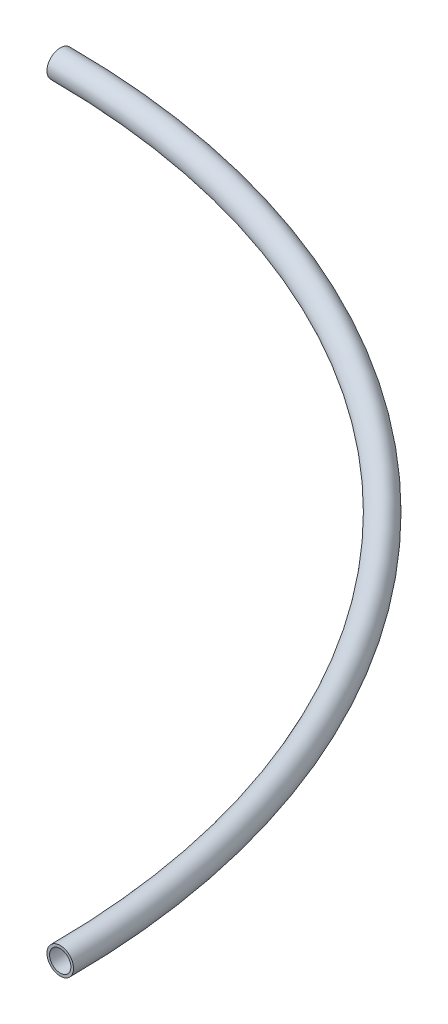
ISO-10303-21;
HEADER;
FILE_DESCRIPTION(('STEP AP214'),'2;1');
FILE_NAME('part.step','',(''),(''),'','','');
FILE_SCHEMA(('AUTOMOTIVE_DESIGN { 1 0 10303 214 1 1 1 1 }'));
ENDSEC;
DATA;
#1=APPLICATION_CONTEXT('core data for automotive mechanical design processes');
#2=APPLICATION_PROTOCOL_DEFINITION('international standard','automotive_design',2000,#1);
#3=PRODUCT_CONTEXT('',#1,'mechanical');
#4=PRODUCT('Part','Part','',(#3));
#5=PRODUCT_RELATED_PRODUCT_CATEGORY('part','',(#4));
#6=PRODUCT_DEFINITION_FORMATION('','',#4);
#7=PRODUCT_DEFINITION_CONTEXT('part definition',#1,'design');
#8=PRODUCT_DEFINITION('design','',#6,#7);
#9=PRODUCT_DEFINITION_SHAPE('','',#8);
#10=(LENGTH_UNIT() NAMED_UNIT(*) SI_UNIT(.MILLI.,.METRE.));
#11=(NAMED_UNIT(*) PLANE_ANGLE_UNIT() SI_UNIT($,.RADIAN.));
#12=(NAMED_UNIT(*) SI_UNIT($,.STERADIAN.) SOLID_ANGLE_UNIT());
#13=UNCERTAINTY_MEASURE_WITH_UNIT(LENGTH_MEASURE(1.E-05),#10,'distance_accuracy_value','');
#14=(GEOMETRIC_REPRESENTATION_CONTEXT(3) GLOBAL_UNCERTAINTY_ASSIGNED_CONTEXT((#13)) GLOBAL_UNIT_ASSIGNED_CONTEXT((#10,
#11,#12)) REPRESENTATION_CONTEXT('',''));
#15=CARTESIAN_POINT('',(0.,0.,0.));
#16=DIRECTION('',(0.,0.,1.));
#17=DIRECTION('',(1.,0.,0.));
#18=AXIS2_PLACEMENT_3D('',#15,#16,#17);
#19=CARTESIAN_POINT('',(0.,0.,0.));
#20=DIRECTION('',(0.,-1.,0.));
#21=DIRECTION('',(0.,0.,-1.));
#22=AXIS2_PLACEMENT_3D('',#19,#20,#21);
#23=TOROIDAL_SURFACE('',#22,1460.,20.);
#24=CARTESIAN_POINT('',(-5.09756275471097E-12,0.,-1460.));
#25=DIRECTION('',(1.,0.,0.));
#26=DIRECTION('',(0.,0.,-1.));
#27=AXIS2_PLACEMENT_3D('',#24,#25,#26);
#28=CIRCLE('',#27,20.);
#29=CARTESIAN_POINT('',(-5.16739238148784E-12,0.,-1480.));
#30=VERTEX_POINT('',#29);
#31=EDGE_CURVE('E53',#30,#30,#28,.T.);
#32=CARTESIAN_POINT('',(1460.,0.,0.));
#33=DIRECTION('',(0.,0.,1.));
#34=DIRECTION('',(1.,0.,0.));
#35=AXIS2_PLACEMENT_3D('',#32,#33,#34);
#36=CIRCLE('',#35,20.);
#37=CARTESIAN_POINT('',(1480.,0.,0.));
#38=VERTEX_POINT('',#37);
#39=EDGE_CURVE('E63',#38,#38,#36,.T.);
#40=CARTESIAN_POINT('',(0.,0.,0.));
#41=DIRECTION('',(0.,-1.,0.));
#42=DIRECTION('',(0.,0.,-1.));
#43=AXIS2_PLACEMENT_3D('',#40,#41,#42);
#44=CIRCLE('',#43,1480.);
#45=EDGE_CURVE('',#30,#38,#44,.T.);
#46=ORIENTED_EDGE('',*,*,#31,.F.);
#47=ORIENTED_EDGE('',*,*,#39,.T.);
#48=ORIENTED_EDGE('',*,*,#45,.T.);
#49=ORIENTED_EDGE('',*,*,#45,.F.);
#50=EDGE_LOOP('',(#46,#48,#47,#49));
#51=FACE_BOUND('',#50,.T.);
#52=ADVANCED_FACE('F45',(#51),#23,.F.);
#53=CARTESIAN_POINT('',(0.,0.,0.));
#54=DIRECTION('',(0.,-1.,0.));
#55=DIRECTION('',(0.,0.,-1.));
#56=AXIS2_PLACEMENT_3D('',#53,#54,#55);
#57=TOROIDAL_SURFACE('',#56,1460.,25.);
#58=CARTESIAN_POINT('',(-5.09756275471097E-12,0.,-1460.));
#59=DIRECTION('',(1.,0.,0.));
#60=DIRECTION('',(0.,0.,-1.));
#61=AXIS2_PLACEMENT_3D('',#58,#59,#60);
#62=CIRCLE('',#61,25.);
#63=CARTESIAN_POINT('',(-5.18484978818205E-12,0.,-1485.));
#64=VERTEX_POINT('',#63);
#65=EDGE_CURVE('E10',#64,#64,#62,.T.);
#66=CARTESIAN_POINT('',(1460.,0.,0.));
#67=DIRECTION('',(0.,0.,1.));
#68=DIRECTION('',(1.,0.,0.));
#69=AXIS2_PLACEMENT_3D('',#66,#67,#68);
#70=CIRCLE('',#69,25.);
#71=CARTESIAN_POINT('',(1485.,0.,0.));
#72=VERTEX_POINT('',#71);
#73=EDGE_CURVE('E58',#72,#72,#70,.T.);
#74=CARTESIAN_POINT('',(0.,0.,0.));
#75=DIRECTION('',(0.,-1.,0.));
#76=DIRECTION('',(0.,0.,-1.));
#77=AXIS2_PLACEMENT_3D('',#74,#75,#76);
#78=CIRCLE('',#77,1485.);
#79=EDGE_CURVE('',#64,#72,#78,.T.);
#80=ORIENTED_EDGE('',*,*,#65,.T.);
#81=ORIENTED_EDGE('',*,*,#73,.F.);
#82=ORIENTED_EDGE('',*,*,#79,.T.);
#83=ORIENTED_EDGE('',*,*,#79,.F.);
#84=EDGE_LOOP('',(#80,#82,#81,#83));
#85=FACE_BOUND('',#84,.T.);
#86=ADVANCED_FACE('F47',(#85),#57,.T.);
#87=CARTESIAN_POINT('',(0.,0.,0.));
#88=DIRECTION('',(1.,0.,0.));
#89=DIRECTION('',(0.,0.,-1.));
#90=AXIS2_PLACEMENT_3D('',#87,#88,#89);
#91=PLANE('',#90);
#92=ORIENTED_EDGE('',*,*,#31,.T.);
#93=EDGE_LOOP('',(#92));
#94=FACE_BOUND('',#93,.T.);
#95=ORIENTED_EDGE('',*,*,#65,.F.);
#96=EDGE_LOOP('',(#95));
#97=FACE_BOUND('',#96,.T.);
#98=ADVANCED_FACE('F74',(#94,#97),#91,.F.);
#99=CARTESIAN_POINT('',(0.,0.,0.));
#100=DIRECTION('',(0.,0.,1.));
#101=DIRECTION('',(1.,0.,0.));
#102=AXIS2_PLACEMENT_3D('',#99,#100,#101);
#103=PLANE('',#102);
#104=ORIENTED_EDGE('',*,*,#39,.F.);
#105=EDGE_LOOP('',(#104));
#106=FACE_BOUND('',#105,.T.);
#107=ORIENTED_EDGE('',*,*,#73,.T.);
#108=EDGE_LOOP('',(#107));
#109=FACE_BOUND('',#108,.T.);
#110=ADVANCED_FACE('F71',(#106,#109),#103,.T.);
#111=CLOSED_SHELL('',(#52,#86,#98,#110));
#112=MANIFOLD_SOLID_BREP('B2',#111);
#113=ADVANCED_BREP_SHAPE_REPRESENTATION('',(#18,#112),#14);
#114=SHAPE_DEFINITION_REPRESENTATION(#9,#113);
ENDSEC;
END-ISO-10303-21;
